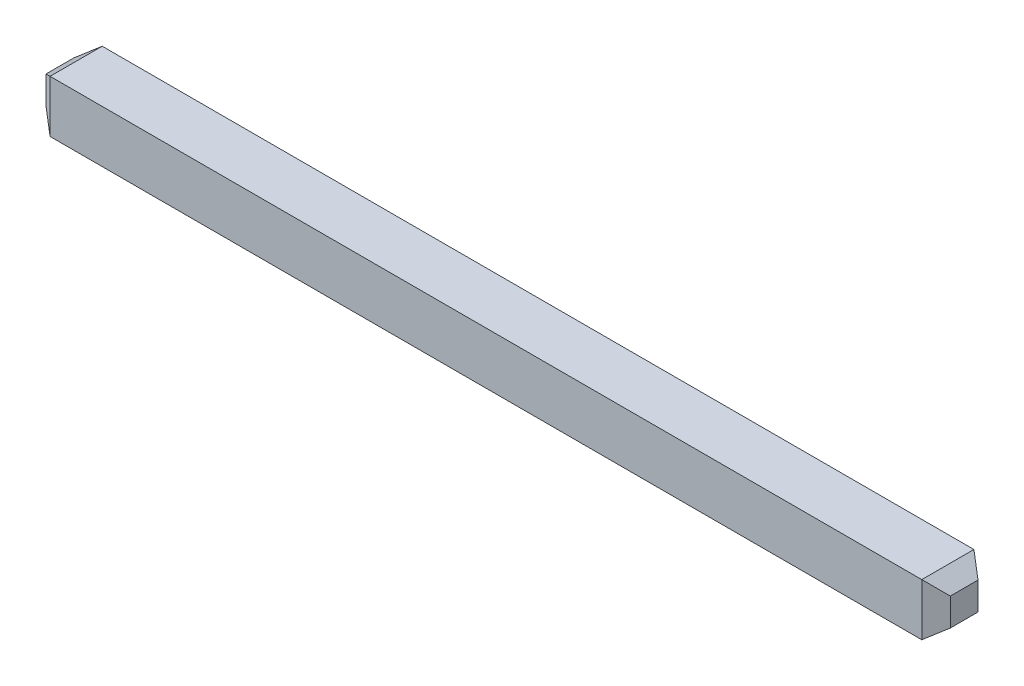
ISO-10303-21;
HEADER;
FILE_DESCRIPTION(('STEP AP214'),'2;1');
FILE_NAME('part.step','',(''),(''),'','','');
FILE_SCHEMA(('AUTOMOTIVE_DESIGN { 1 0 10303 214 1 1 1 1 }'));
ENDSEC;
DATA;
#1=APPLICATION_CONTEXT('core data for automotive mechanical design processes');
#2=APPLICATION_PROTOCOL_DEFINITION('international standard','automotive_design',2000,#1);
#3=PRODUCT_CONTEXT('',#1,'mechanical');
#4=PRODUCT('Part','Part','',(#3));
#5=PRODUCT_RELATED_PRODUCT_CATEGORY('part','',(#4));
#6=PRODUCT_DEFINITION_FORMATION('','',#4);
#7=PRODUCT_DEFINITION_CONTEXT('part definition',#1,'design');
#8=PRODUCT_DEFINITION('design','',#6,#7);
#9=PRODUCT_DEFINITION_SHAPE('','',#8);
#10=(LENGTH_UNIT() NAMED_UNIT(*) SI_UNIT(.MILLI.,.METRE.));
#11=(NAMED_UNIT(*) PLANE_ANGLE_UNIT() SI_UNIT($,.RADIAN.));
#12=(NAMED_UNIT(*) SI_UNIT($,.STERADIAN.) SOLID_ANGLE_UNIT());
#13=UNCERTAINTY_MEASURE_WITH_UNIT(LENGTH_MEASURE(1.E-05),#10,'distance_accuracy_value','');
#14=(GEOMETRIC_REPRESENTATION_CONTEXT(3) GLOBAL_UNCERTAINTY_ASSIGNED_CONTEXT((#13)) GLOBAL_UNIT_ASSIGNED_CONTEXT((#10,
#11,#12)) REPRESENTATION_CONTEXT('',''));
#15=CARTESIAN_POINT('',(0.,0.,0.));
#16=DIRECTION('',(0.,0.,1.));
#17=DIRECTION('',(1.,0.,0.));
#18=AXIS2_PLACEMENT_3D('',#15,#16,#17);
#19=CARTESIAN_POINT('',(-2.4,3.77,-6.595));
#20=DIRECTION('',(0.6,0.,0.8));
#21=DIRECTION('',(0.8,0.,-0.6));
#22=AXIS2_PLACEMENT_3D('',#19,#20,#21);
#23=PLANE('',#22);
#24=DIRECTION('',(0.,1.,0.));
#25=VECTOR('',#24,1.);
#26=CARTESIAN_POINT('',(-2.3,3.77,-6.67));
#27=LINE('',#26,#25);
#28=CARTESIAN_POINT('',(-2.3,4.09,-6.67));
#29=VERTEX_POINT('',#28);
#30=CARTESIAN_POINT('',(-2.3,3.45,-6.67));
#31=VERTEX_POINT('',#30);
#32=EDGE_CURVE('E101',#29,#31,#27,.F.);
#33=ORIENTED_EDGE('',*,*,#32,.T.);
#34=DIRECTION('',(-0.685994340570036,0.514495755427526,0.514495755427526));
#35=VECTOR('',#34,1.);
#36=CARTESIAN_POINT('',(-2.3,3.45,-6.67));
#37=LINE('',#36,#35);
#38=CARTESIAN_POINT('',(-2.5,3.6,-6.52));
#39=VERTEX_POINT('',#38);
#40=EDGE_CURVE('E85',#31,#39,#37,.T.);
#41=ORIENTED_EDGE('',*,*,#40,.T.);
#42=DIRECTION('',(0.,1.,0.));
#43=VECTOR('',#42,1.);
#44=CARTESIAN_POINT('',(-2.5,3.77,-6.52));
#45=LINE('',#44,#43);
#46=CARTESIAN_POINT('',(-2.5,3.94,-6.52));
#47=VERTEX_POINT('',#46);
#48=EDGE_CURVE('E79',#39,#47,#45,.T.);
#49=ORIENTED_EDGE('',*,*,#48,.T.);
#50=DIRECTION('',(-0.685994340570036,-0.514495755427526,0.514495755427526));
#51=VECTOR('',#50,1.);
#52=CARTESIAN_POINT('',(-2.3,4.09,-6.67));
#53=LINE('',#52,#51);
#54=EDGE_CURVE('E20',#29,#47,#53,.T.);
#55=ORIENTED_EDGE('',*,*,#54,.F.);
#56=EDGE_LOOP('',(#33,#41,#49,#55));
#57=FACE_BOUND('',#56,.T.);
#58=ADVANCED_FACE('F17',(#57),#23,.F.);
#59=CARTESIAN_POINT('',(8.5,3.77,-6.595));
#60=DIRECTION('',(-0.6,0.,0.8));
#61=DIRECTION('',(0.8,0.,0.6));
#62=AXIS2_PLACEMENT_3D('',#59,#60,#61);
#63=PLANE('',#62);
#64=DIRECTION('',(0.,1.,0.));
#65=VECTOR('',#64,1.);
#66=CARTESIAN_POINT('',(8.6,3.77,-6.52));
#67=LINE('',#66,#65);
#68=CARTESIAN_POINT('',(8.6,3.6,-6.52));
#69=VERTEX_POINT('',#68);
#70=CARTESIAN_POINT('',(8.6,3.94,-6.52));
#71=VERTEX_POINT('',#70);
#72=EDGE_CURVE('E113',#69,#71,#67,.T.);
#73=ORIENTED_EDGE('',*,*,#72,.F.);
#74=DIRECTION('',(-0.685994340570034,-0.514495755427526,-0.514495755427529));
#75=VECTOR('',#74,1.);
#76=CARTESIAN_POINT('',(8.6,3.6,-6.52));
#77=LINE('',#76,#75);
#78=CARTESIAN_POINT('',(8.4,3.45,-6.67));
#79=VERTEX_POINT('',#78);
#80=EDGE_CURVE('E108',#69,#79,#77,.T.);
#81=ORIENTED_EDGE('',*,*,#80,.T.);
#82=DIRECTION('',(0.,1.,0.));
#83=VECTOR('',#82,1.);
#84=CARTESIAN_POINT('',(8.4,3.77,-6.67));
#85=LINE('',#84,#83);
#86=CARTESIAN_POINT('',(8.4,4.09,-6.67));
#87=VERTEX_POINT('',#86);
#88=EDGE_CURVE('E99',#79,#87,#85,.T.);
#89=ORIENTED_EDGE('',*,*,#88,.T.);
#90=DIRECTION('',(-0.685994340570034,0.514495755427526,-0.514495755427529));
#91=VECTOR('',#90,1.);
#92=CARTESIAN_POINT('',(8.6,3.94,-6.52));
#93=LINE('',#92,#91);
#94=EDGE_CURVE('E116',#71,#87,#93,.T.);
#95=ORIENTED_EDGE('',*,*,#94,.F.);
#96=EDGE_LOOP('',(#73,#81,#89,#95));
#97=FACE_BOUND('',#96,.T.);
#98=ADVANCED_FACE('F214',(#97),#63,.F.);
#99=CARTESIAN_POINT('',(-2.4,4.015,-6.35));
#100=DIRECTION('',(-0.6,0.8,0.));
#101=DIRECTION('',(-0.8,-0.6,0.));
#102=AXIS2_PLACEMENT_3D('',#99,#100,#101);
#103=PLANE('',#102);
#104=DIRECTION('',(-0.685994340570036,-0.514495755427528,-0.514495755427525));
#105=VECTOR('',#104,1.);
#106=CARTESIAN_POINT('',(-2.3,4.09,-6.03));
#107=LINE('',#106,#105);
#108=CARTESIAN_POINT('',(-2.3,4.09,-6.03));
#109=VERTEX_POINT('',#108);
#110=CARTESIAN_POINT('',(-2.5,3.94,-6.18));
#111=VERTEX_POINT('',#110);
#112=EDGE_CURVE('E128',#109,#111,#107,.T.);
#113=ORIENTED_EDGE('',*,*,#112,.F.);
#114=DIRECTION('',(0.,0.,1.));
#115=VECTOR('',#114,1.);
#116=CARTESIAN_POINT('',(-2.3,4.09,-6.35));
#117=LINE('',#116,#115);
#118=EDGE_CURVE('E93',#29,#109,#117,.T.);
#119=ORIENTED_EDGE('',*,*,#118,.F.);
#120=ORIENTED_EDGE('',*,*,#54,.T.);
#121=DIRECTION('',(0.,0.,-1.));
#122=VECTOR('',#121,1.);
#123=CARTESIAN_POINT('',(-2.5,3.94,-6.35));
#124=LINE('',#123,#122);
#125=EDGE_CURVE('E87',#47,#111,#124,.F.);
#126=ORIENTED_EDGE('',*,*,#125,.T.);
#127=EDGE_LOOP('',(#113,#119,#120,#126));
#128=FACE_BOUND('',#127,.T.);
#129=ADVANCED_FACE('F90',(#128),#103,.T.);
#130=CARTESIAN_POINT('',(-2.5,3.77,-6.35));
#131=DIRECTION('',(1.,0.,0.));
#132=DIRECTION('',(0.,0.,-1.));
#133=AXIS2_PLACEMENT_3D('',#130,#131,#132);
#134=PLANE('',#133);
#135=DIRECTION('',(0.,1.,0.));
#136=VECTOR('',#135,1.);
#137=CARTESIAN_POINT('',(-2.5,3.77,-6.18));
#138=LINE('',#137,#136);
#139=CARTESIAN_POINT('',(-2.5,3.6,-6.18));
#140=VERTEX_POINT('',#139);
#141=EDGE_CURVE('E97',#111,#140,#138,.F.);
#142=ORIENTED_EDGE('',*,*,#141,.F.);
#143=ORIENTED_EDGE('',*,*,#125,.F.);
#144=ORIENTED_EDGE('',*,*,#48,.F.);
#145=DIRECTION('',(0.,0.,1.));
#146=VECTOR('',#145,1.);
#147=CARTESIAN_POINT('',(-2.5,3.6,-6.35));
#148=LINE('',#147,#146);
#149=EDGE_CURVE('E105',#39,#140,#148,.T.);
#150=ORIENTED_EDGE('',*,*,#149,.T.);
#151=EDGE_LOOP('',(#142,#143,#144,#150));
#152=FACE_BOUND('',#151,.T.);
#153=ADVANCED_FACE('F95',(#152),#134,.F.);
#154=CARTESIAN_POINT('',(3.05,3.77,-6.67));
#155=DIRECTION('',(0.,0.,1.));
#156=DIRECTION('',(1.,0.,0.));
#157=AXIS2_PLACEMENT_3D('',#154,#155,#156);
#158=PLANE('',#157);
#159=ORIENTED_EDGE('',*,*,#32,.F.);
#160=DIRECTION('',(1.,0.,0.));
#161=VECTOR('',#160,1.);
#162=CARTESIAN_POINT('',(3.05,4.09,-6.67));
#163=LINE('',#162,#161);
#164=EDGE_CURVE('E122',#87,#29,#163,.F.);
#165=ORIENTED_EDGE('',*,*,#164,.F.);
#166=ORIENTED_EDGE('',*,*,#88,.F.);
#167=DIRECTION('',(1.,0.,0.));
#168=VECTOR('',#167,1.);
#169=CARTESIAN_POINT('',(3.05,3.45,-6.67));
#170=LINE('',#169,#168);
#171=EDGE_CURVE('E136',#79,#31,#170,.F.);
#172=ORIENTED_EDGE('',*,*,#171,.T.);
#173=EDGE_LOOP('',(#159,#165,#166,#172));
#174=FACE_BOUND('',#173,.T.);
#175=ADVANCED_FACE('F182',(#174),#158,.F.);
#176=CARTESIAN_POINT('',(-2.4,3.525,-6.35));
#177=DIRECTION('',(0.6,0.8,0.));
#178=DIRECTION('',(-0.8,0.6,0.));
#179=AXIS2_PLACEMENT_3D('',#176,#177,#178);
#180=PLANE('',#179);
#181=DIRECTION('',(0.,0.,1.));
#182=VECTOR('',#181,1.);
#183=CARTESIAN_POINT('',(-2.3,3.45,-6.35));
#184=LINE('',#183,#182);
#185=CARTESIAN_POINT('',(-2.3,3.45,-6.03));
#186=VERTEX_POINT('',#185);
#187=EDGE_CURVE('E139',#31,#186,#184,.T.);
#188=ORIENTED_EDGE('',*,*,#187,.T.);
#189=DIRECTION('',(0.685994340570036,-0.514495755427528,0.514495755427525));
#190=VECTOR('',#189,1.);
#191=CARTESIAN_POINT('',(-2.5,3.6,-6.18));
#192=LINE('',#191,#190);
#193=EDGE_CURVE('E131',#140,#186,#192,.T.);
#194=ORIENTED_EDGE('',*,*,#193,.F.);
#195=ORIENTED_EDGE('',*,*,#149,.F.);
#196=ORIENTED_EDGE('',*,*,#40,.F.);
#197=EDGE_LOOP('',(#188,#194,#195,#196));
#198=FACE_BOUND('',#197,.T.);
#199=ADVANCED_FACE('F179',(#198),#180,.F.);
#200=CARTESIAN_POINT('',(8.5,3.525,-6.35));
#201=DIRECTION('',(-0.6,0.8,0.));
#202=DIRECTION('',(-0.8,-0.6,0.));
#203=AXIS2_PLACEMENT_3D('',#200,#201,#202);
#204=PLANE('',#203);
#205=DIRECTION('',(0.,0.,-1.));
#206=VECTOR('',#205,1.);
#207=CARTESIAN_POINT('',(8.6,3.6,-6.35));
#208=LINE('',#207,#206);
#209=CARTESIAN_POINT('',(8.6,3.6,-6.18));
#210=VERTEX_POINT('',#209);
#211=EDGE_CURVE('E110',#210,#69,#208,.T.);
#212=ORIENTED_EDGE('',*,*,#211,.F.);
#213=DIRECTION('',(0.685994340570034,0.514495755427529,-0.514495755427526));
#214=VECTOR('',#213,1.);
#215=CARTESIAN_POINT('',(8.4,3.45,-6.03));
#216=LINE('',#215,#214);
#217=CARTESIAN_POINT('',(8.4,3.45,-6.03));
#218=VERTEX_POINT('',#217);
#219=EDGE_CURVE('E35',#218,#210,#216,.T.);
#220=ORIENTED_EDGE('',*,*,#219,.F.);
#221=DIRECTION('',(0.,0.,1.));
#222=VECTOR('',#221,1.);
#223=CARTESIAN_POINT('',(8.4,3.45,-6.35));
#224=LINE('',#223,#222);
#225=EDGE_CURVE('E134',#218,#79,#224,.F.);
#226=ORIENTED_EDGE('',*,*,#225,.T.);
#227=ORIENTED_EDGE('',*,*,#80,.F.);
#228=EDGE_LOOP('',(#212,#220,#226,#227));
#229=FACE_BOUND('',#228,.T.);
#230=ADVANCED_FACE('F181',(#229),#204,.F.);
#231=CARTESIAN_POINT('',(8.6,3.77,-6.35));
#232=DIRECTION('',(1.,0.,0.));
#233=DIRECTION('',(0.,0.,-1.));
#234=AXIS2_PLACEMENT_3D('',#231,#232,#233);
#235=PLANE('',#234);
#236=ORIENTED_EDGE('',*,*,#72,.T.);
#237=DIRECTION('',(0.,0.,1.));
#238=VECTOR('',#237,1.);
#239=CARTESIAN_POINT('',(8.6,3.94,-6.35));
#240=LINE('',#239,#238);
#241=CARTESIAN_POINT('',(8.6,3.94,-6.18));
#242=VERTEX_POINT('',#241);
#243=EDGE_CURVE('E119',#242,#71,#240,.F.);
#244=ORIENTED_EDGE('',*,*,#243,.F.);
#245=DIRECTION('',(0.,1.,0.));
#246=VECTOR('',#245,1.);
#247=CARTESIAN_POINT('',(8.6,3.77,-6.18));
#248=LINE('',#247,#246);
#249=EDGE_CURVE('E142',#210,#242,#248,.T.);
#250=ORIENTED_EDGE('',*,*,#249,.F.);
#251=ORIENTED_EDGE('',*,*,#211,.T.);
#252=EDGE_LOOP('',(#236,#244,#250,#251));
#253=FACE_BOUND('',#252,.T.);
#254=ADVANCED_FACE('F189',(#253),#235,.T.);
#255=CARTESIAN_POINT('',(8.5,4.015,-6.35));
#256=DIRECTION('',(0.6,0.8,0.));
#257=DIRECTION('',(-0.8,0.6,0.));
#258=AXIS2_PLACEMENT_3D('',#255,#256,#257);
#259=PLANE('',#258);
#260=DIRECTION('',(-0.685994340570034,0.514495755427529,0.514495755427526));
#261=VECTOR('',#260,1.);
#262=CARTESIAN_POINT('',(8.6,3.94,-6.18));
#263=LINE('',#262,#261);
#264=CARTESIAN_POINT('',(8.4,4.09,-6.03));
#265=VERTEX_POINT('',#264);
#266=EDGE_CURVE('E145',#242,#265,#263,.T.);
#267=ORIENTED_EDGE('',*,*,#266,.F.);
#268=ORIENTED_EDGE('',*,*,#243,.T.);
#269=ORIENTED_EDGE('',*,*,#94,.T.);
#270=DIRECTION('',(0.,0.,1.));
#271=VECTOR('',#270,1.);
#272=CARTESIAN_POINT('',(8.4,4.09,-6.35));
#273=LINE('',#272,#271);
#274=EDGE_CURVE('E125',#265,#87,#273,.F.);
#275=ORIENTED_EDGE('',*,*,#274,.F.);
#276=EDGE_LOOP('',(#267,#268,#269,#275));
#277=FACE_BOUND('',#276,.T.);
#278=ADVANCED_FACE('F170',(#277),#259,.T.);
#279=CARTESIAN_POINT('',(3.05,4.09,-6.35));
#280=DIRECTION('',(0.,1.,0.));
#281=DIRECTION('',(0.,0.,1.));
#282=AXIS2_PLACEMENT_3D('',#279,#280,#281);
#283=PLANE('',#282);
#284=DIRECTION('',(1.,0.,0.));
#285=VECTOR('',#284,1.);
#286=CARTESIAN_POINT('',(3.05,4.09,-6.03));
#287=LINE('',#286,#285);
#288=EDGE_CURVE('E148',#265,#109,#287,.F.);
#289=ORIENTED_EDGE('',*,*,#288,.F.);
#290=ORIENTED_EDGE('',*,*,#274,.T.);
#291=ORIENTED_EDGE('',*,*,#164,.T.);
#292=ORIENTED_EDGE('',*,*,#118,.T.);
#293=EDGE_LOOP('',(#289,#290,#291,#292));
#294=FACE_BOUND('',#293,.T.);
#295=ADVANCED_FACE('F173',(#294),#283,.T.);
#296=CARTESIAN_POINT('',(-2.4,3.77,-6.105));
#297=DIRECTION('',(-0.6,0.,0.8));
#298=DIRECTION('',(0.8,0.,0.6));
#299=AXIS2_PLACEMENT_3D('',#296,#297,#298);
#300=PLANE('',#299);
#301=ORIENTED_EDGE('',*,*,#193,.T.);
#302=DIRECTION('',(0.,1.,0.));
#303=VECTOR('',#302,1.);
#304=CARTESIAN_POINT('',(-2.3,3.77,-6.03));
#305=LINE('',#304,#303);
#306=EDGE_CURVE('E151',#109,#186,#305,.F.);
#307=ORIENTED_EDGE('',*,*,#306,.F.);
#308=ORIENTED_EDGE('',*,*,#112,.T.);
#309=ORIENTED_EDGE('',*,*,#141,.T.);
#310=EDGE_LOOP('',(#301,#307,#308,#309));
#311=FACE_BOUND('',#310,.T.);
#312=ADVANCED_FACE('F176',(#311),#300,.T.);
#313=CARTESIAN_POINT('',(3.05,3.45,-6.35));
#314=DIRECTION('',(0.,1.,0.));
#315=DIRECTION('',(0.,0.,1.));
#316=AXIS2_PLACEMENT_3D('',#313,#314,#315);
#317=PLANE('',#316);
#318=ORIENTED_EDGE('',*,*,#187,.F.);
#319=ORIENTED_EDGE('',*,*,#171,.F.);
#320=ORIENTED_EDGE('',*,*,#225,.F.);
#321=DIRECTION('',(1.,0.,0.));
#322=VECTOR('',#321,1.);
#323=CARTESIAN_POINT('',(3.05,3.45,-6.03));
#324=LINE('',#323,#322);
#325=EDGE_CURVE('E26',#186,#218,#324,.T.);
#326=ORIENTED_EDGE('',*,*,#325,.F.);
#327=EDGE_LOOP('',(#318,#319,#320,#326));
#328=FACE_BOUND('',#327,.T.);
#329=ADVANCED_FACE('F162',(#328),#317,.F.);
#330=CARTESIAN_POINT('',(8.5,3.77,-6.105));
#331=DIRECTION('',(0.6,0.,0.8));
#332=DIRECTION('',(0.8,0.,-0.6));
#333=AXIS2_PLACEMENT_3D('',#330,#331,#332);
#334=PLANE('',#333);
#335=ORIENTED_EDGE('',*,*,#266,.T.);
#336=DIRECTION('',(0.,1.,0.));
#337=VECTOR('',#336,1.);
#338=CARTESIAN_POINT('',(8.4,3.77,-6.03));
#339=LINE('',#338,#337);
#340=EDGE_CURVE('E11',#218,#265,#339,.T.);
#341=ORIENTED_EDGE('',*,*,#340,.F.);
#342=ORIENTED_EDGE('',*,*,#219,.T.);
#343=ORIENTED_EDGE('',*,*,#249,.T.);
#344=EDGE_LOOP('',(#335,#341,#342,#343));
#345=FACE_BOUND('',#344,.T.);
#346=ADVANCED_FACE('F166',(#345),#334,.T.);
#347=CARTESIAN_POINT('',(3.05,3.77,-6.03));
#348=DIRECTION('',(0.,0.,1.));
#349=DIRECTION('',(1.,0.,0.));
#350=AXIS2_PLACEMENT_3D('',#347,#348,#349);
#351=PLANE('',#350);
#352=ORIENTED_EDGE('',*,*,#325,.T.);
#353=ORIENTED_EDGE('',*,*,#340,.T.);
#354=ORIENTED_EDGE('',*,*,#288,.T.);
#355=ORIENTED_EDGE('',*,*,#306,.T.);
#356=EDGE_LOOP('',(#352,#353,#354,#355));
#357=FACE_BOUND('',#356,.T.);
#358=ADVANCED_FACE('F157',(#357),#351,.T.);
#359=CLOSED_SHELL('',(#58,#98,#129,#153,#175,#199,#230,#254,#278,#295,#312,#329,#346,#358));
#360=MANIFOLD_SOLID_BREP('B1',#359);
#361=ADVANCED_BREP_SHAPE_REPRESENTATION('',(#18,#360),#14);
#362=SHAPE_DEFINITION_REPRESENTATION(#9,#361);
ENDSEC;
END-ISO-10303-21;
